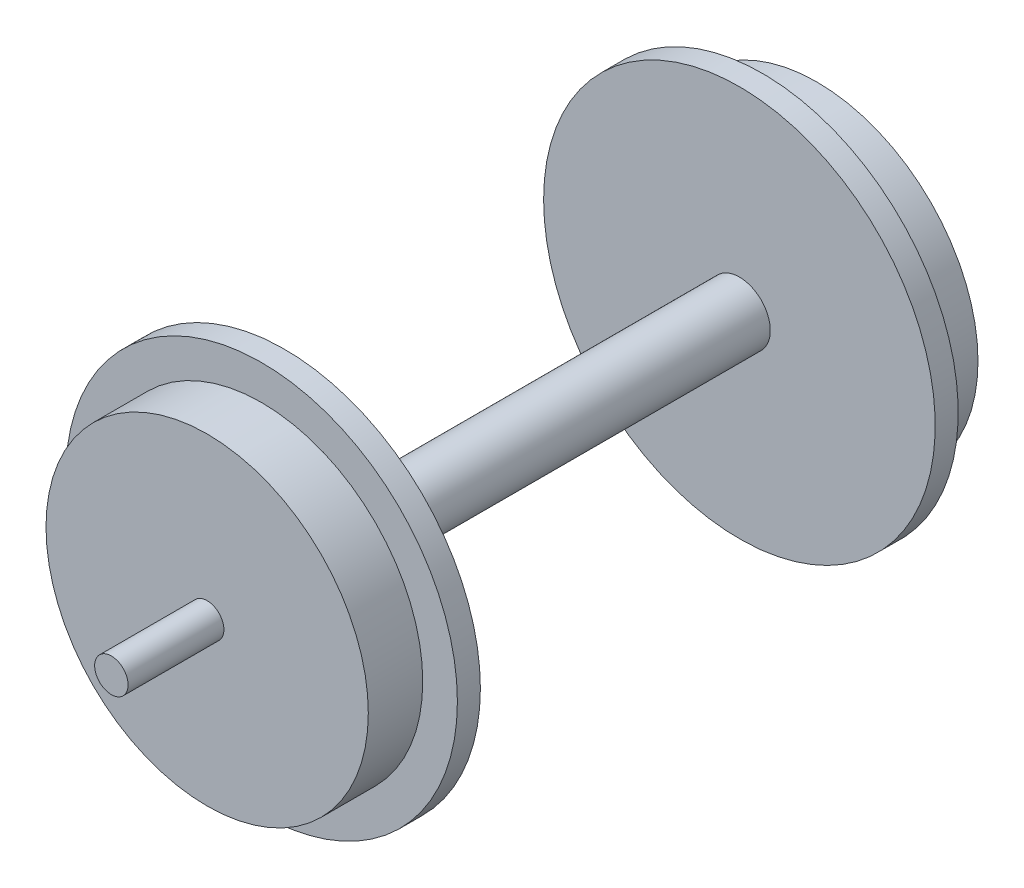
ISO-10303-21;
HEADER;
FILE_DESCRIPTION(('STEP AP214'),'2;1');
FILE_NAME('part.step','',(''),(''),'','','');
FILE_SCHEMA(('AUTOMOTIVE_DESIGN { 1 0 10303 214 1 1 1 1 }'));
ENDSEC;
DATA;
#1=APPLICATION_CONTEXT('core data for automotive mechanical design processes');
#2=APPLICATION_PROTOCOL_DEFINITION('international standard','automotive_design',2000,#1);
#3=PRODUCT_CONTEXT('',#1,'mechanical');
#4=PRODUCT('Part','Part','',(#3));
#5=PRODUCT_RELATED_PRODUCT_CATEGORY('part','',(#4));
#6=PRODUCT_DEFINITION_FORMATION('','',#4);
#7=PRODUCT_DEFINITION_CONTEXT('part definition',#1,'design');
#8=PRODUCT_DEFINITION('design','',#6,#7);
#9=PRODUCT_DEFINITION_SHAPE('','',#8);
#10=(LENGTH_UNIT() NAMED_UNIT(*) SI_UNIT(.MILLI.,.METRE.));
#11=(NAMED_UNIT(*) PLANE_ANGLE_UNIT() SI_UNIT($,.RADIAN.));
#12=(NAMED_UNIT(*) SI_UNIT($,.STERADIAN.) SOLID_ANGLE_UNIT());
#13=UNCERTAINTY_MEASURE_WITH_UNIT(LENGTH_MEASURE(1.E-05),#10,'distance_accuracy_value','');
#14=(GEOMETRIC_REPRESENTATION_CONTEXT(3) GLOBAL_UNCERTAINTY_ASSIGNED_CONTEXT((#13)) GLOBAL_UNIT_ASSIGNED_CONTEXT((#10,
#11,#12)) REPRESENTATION_CONTEXT('',''));
#15=CARTESIAN_POINT('',(0.,0.,0.));
#16=DIRECTION('',(0.,0.,1.));
#17=DIRECTION('',(1.,0.,0.));
#18=AXIS2_PLACEMENT_3D('',#15,#16,#17);
#19=CARTESIAN_POINT('',(0.,0.,2.04));
#20=DIRECTION('',(0.,0.,-1.));
#21=DIRECTION('',(-1.,0.,0.));
#22=AXIS2_PLACEMENT_3D('',#19,#20,#21);
#23=CYLINDRICAL_SURFACE('',#22,17.375);
#24=CARTESIAN_POINT('',(0.,0.,2.04));
#25=DIRECTION('',(0.,0.,1.));
#26=DIRECTION('',(1.,0.,0.));
#27=AXIS2_PLACEMENT_3D('',#24,#25,#26);
#28=CIRCLE('',#27,17.375);
#29=CARTESIAN_POINT('',(17.375,0.,2.04));
#30=VERTEX_POINT('',#29);
#31=EDGE_CURVE('E65',#30,#30,#28,.T.);
#32=ORIENTED_EDGE('',*,*,#31,.F.);
#33=EDGE_LOOP('',(#32));
#34=FACE_BOUND('',#33,.T.);
#35=CARTESIAN_POINT('',(0.,0.,0.));
#36=DIRECTION('',(0.,0.,1.));
#37=DIRECTION('',(1.,0.,0.));
#38=AXIS2_PLACEMENT_3D('',#35,#36,#37);
#39=CIRCLE('',#38,17.375);
#40=CARTESIAN_POINT('',(17.375,0.,0.));
#41=VERTEX_POINT('',#40);
#42=EDGE_CURVE('E37',#41,#41,#39,.T.);
#43=ORIENTED_EDGE('',*,*,#42,.T.);
#44=EDGE_LOOP('',(#43));
#45=FACE_BOUND('',#44,.T.);
#46=ADVANCED_FACE('F34',(#34,#45),#23,.T.);
#47=CARTESIAN_POINT('',(0.,0.,2.04));
#48=DIRECTION('',(0.,0.,1.));
#49=DIRECTION('',(1.,0.,0.));
#50=AXIS2_PLACEMENT_3D('',#47,#48,#49);
#51=PLANE('',#50);
#52=CARTESIAN_POINT('',(0.,0.,2.04));
#53=DIRECTION('',(0.,0.,1.));
#54=DIRECTION('',(1.,0.,0.));
#55=AXIS2_PLACEMENT_3D('',#52,#53,#54);
#56=CIRCLE('',#55,14.3);
#57=CARTESIAN_POINT('',(14.3,0.,2.04));
#58=VERTEX_POINT('',#57);
#59=EDGE_CURVE('E46',#58,#58,#56,.T.);
#60=ORIENTED_EDGE('',*,*,#59,.F.);
#61=EDGE_LOOP('',(#60));
#62=FACE_BOUND('',#61,.T.);
#63=ORIENTED_EDGE('',*,*,#31,.T.);
#64=EDGE_LOOP('',(#63));
#65=FACE_BOUND('',#64,.T.);
#66=ADVANCED_FACE('F76',(#62,#65),#51,.T.);
#67=CARTESIAN_POINT('',(0.,0.,0.));
#68=DIRECTION('',(0.,0.,1.));
#69=DIRECTION('',(1.,0.,0.));
#70=AXIS2_PLACEMENT_3D('',#67,#68,#69);
#71=PLANE('',#70);
#72=CARTESIAN_POINT('',(0.,0.,0.));
#73=DIRECTION('',(0.,0.,-1.));
#74=DIRECTION('',(-1.,0.,0.));
#75=AXIS2_PLACEMENT_3D('',#72,#73,#74);
#76=CIRCLE('',#75,2.74);
#77=CARTESIAN_POINT('',(-2.74,0.,0.));
#78=VERTEX_POINT('',#77);
#79=EDGE_CURVE('E41',#78,#78,#76,.T.);
#80=ORIENTED_EDGE('',*,*,#79,.F.);
#81=EDGE_LOOP('',(#80));
#82=FACE_BOUND('',#81,.T.);
#83=ORIENTED_EDGE('',*,*,#42,.F.);
#84=EDGE_LOOP('',(#83));
#85=FACE_BOUND('',#84,.T.);
#86=ADVANCED_FACE('F73',(#82,#85),#71,.F.);
#87=CARTESIAN_POINT('',(0.,0.,6.87));
#88=DIRECTION('',(0.,0.,-1.));
#89=DIRECTION('',(-1.,0.,0.));
#90=AXIS2_PLACEMENT_3D('',#87,#88,#89);
#91=CYLINDRICAL_SURFACE('',#90,14.3);
#92=CARTESIAN_POINT('',(0.,0.,6.87));
#93=DIRECTION('',(0.,0.,1.));
#94=DIRECTION('',(1.,0.,0.));
#95=AXIS2_PLACEMENT_3D('',#92,#93,#94);
#96=CIRCLE('',#95,14.3);
#97=CARTESIAN_POINT('',(14.3,0.,6.87));
#98=VERTEX_POINT('',#97);
#99=EDGE_CURVE('E60',#98,#98,#96,.T.);
#100=ORIENTED_EDGE('',*,*,#99,.F.);
#101=EDGE_LOOP('',(#100));
#102=FACE_BOUND('',#101,.T.);
#103=ORIENTED_EDGE('',*,*,#59,.T.);
#104=EDGE_LOOP('',(#103));
#105=FACE_BOUND('',#104,.T.);
#106=ADVANCED_FACE('F75',(#102,#105),#91,.T.);
#107=CARTESIAN_POINT('',(0.,0.,6.87));
#108=DIRECTION('',(0.,0.,1.));
#109=DIRECTION('',(1.,0.,0.));
#110=AXIS2_PLACEMENT_3D('',#107,#108,#109);
#111=PLANE('',#110);
#112=CARTESIAN_POINT('',(0.,0.,6.87));
#113=DIRECTION('',(0.,0.,1.));
#114=DIRECTION('',(1.,0.,0.));
#115=AXIS2_PLACEMENT_3D('',#112,#113,#114);
#116=CIRCLE('',#115,1.485);
#117=CARTESIAN_POINT('',(1.485,0.,6.87));
#118=VERTEX_POINT('',#117);
#119=EDGE_CURVE('E223',#118,#118,#116,.T.);
#120=ORIENTED_EDGE('',*,*,#119,.F.);
#121=EDGE_LOOP('',(#120));
#122=FACE_BOUND('',#121,.T.);
#123=ORIENTED_EDGE('',*,*,#99,.T.);
#124=EDGE_LOOP('',(#123));
#125=FACE_BOUND('',#124,.T.);
#126=ADVANCED_FACE('F82',(#122,#125),#111,.T.);
#127=CARTESIAN_POINT('',(0.,0.,-40.36));
#128=DIRECTION('',(0.,0.,1.));
#129=DIRECTION('',(1.,0.,0.));
#130=AXIS2_PLACEMENT_3D('',#127,#128,#129);
#131=CYLINDRICAL_SURFACE('',#130,2.74);
#132=CARTESIAN_POINT('',(0.,0.,-40.36));
#133=DIRECTION('',(0.,0.,-1.));
#134=DIRECTION('',(-1.,0.,0.));
#135=AXIS2_PLACEMENT_3D('',#132,#133,#134);
#136=CIRCLE('',#135,2.74);
#137=CARTESIAN_POINT('',(-2.74,0.,-40.36));
#138=VERTEX_POINT('',#137);
#139=EDGE_CURVE('E55',#138,#138,#136,.T.);
#140=ORIENTED_EDGE('',*,*,#139,.F.);
#141=EDGE_LOOP('',(#140));
#142=FACE_BOUND('',#141,.T.);
#143=ORIENTED_EDGE('',*,*,#79,.T.);
#144=EDGE_LOOP('',(#143));
#145=FACE_BOUND('',#144,.T.);
#146=ADVANCED_FACE('F113',(#142,#145),#131,.T.);
#147=CARTESIAN_POINT('',(0.,0.,-42.4));
#148=DIRECTION('',(0.,0.,1.));
#149=DIRECTION('',(1.,0.,0.));
#150=AXIS2_PLACEMENT_3D('',#147,#148,#149);
#151=CYLINDRICAL_SURFACE('',#150,17.375);
#152=CARTESIAN_POINT('',(0.,0.,-42.4));
#153=DIRECTION('',(0.,0.,-1.));
#154=DIRECTION('',(-1.,0.,0.));
#155=AXIS2_PLACEMENT_3D('',#152,#153,#154);
#156=CIRCLE('',#155,17.375);
#157=CARTESIAN_POINT('',(-17.375,0.,-42.4));
#158=VERTEX_POINT('',#157);
#159=EDGE_CURVE('E52',#158,#158,#156,.T.);
#160=ORIENTED_EDGE('',*,*,#159,.F.);
#161=EDGE_LOOP('',(#160));
#162=FACE_BOUND('',#161,.T.);
#163=CARTESIAN_POINT('',(0.,0.,-40.36));
#164=DIRECTION('',(0.,0.,-1.));
#165=DIRECTION('',(-1.,0.,0.));
#166=AXIS2_PLACEMENT_3D('',#163,#164,#165);
#167=CIRCLE('',#166,17.375);
#168=CARTESIAN_POINT('',(-17.375,0.,-40.36));
#169=VERTEX_POINT('',#168);
#170=EDGE_CURVE('E56',#169,#169,#167,.T.);
#171=ORIENTED_EDGE('',*,*,#170,.T.);
#172=EDGE_LOOP('',(#171));
#173=FACE_BOUND('',#172,.T.);
#174=ADVANCED_FACE('F118',(#162,#173),#151,.T.);
#175=CARTESIAN_POINT('',(0.,0.,-42.4));
#176=DIRECTION('',(0.,0.,-1.));
#177=DIRECTION('',(-1.,0.,0.));
#178=AXIS2_PLACEMENT_3D('',#175,#176,#177);
#179=PLANE('',#178);
#180=CARTESIAN_POINT('',(0.,0.,-42.4));
#181=DIRECTION('',(0.,0.,-1.));
#182=DIRECTION('',(-1.,0.,0.));
#183=AXIS2_PLACEMENT_3D('',#180,#181,#182);
#184=CIRCLE('',#183,14.3);
#185=CARTESIAN_POINT('',(-14.3,0.,-42.4));
#186=VERTEX_POINT('',#185);
#187=EDGE_CURVE('E10',#186,#186,#184,.T.);
#188=ORIENTED_EDGE('',*,*,#187,.F.);
#189=EDGE_LOOP('',(#188));
#190=FACE_BOUND('',#189,.T.);
#191=ORIENTED_EDGE('',*,*,#159,.T.);
#192=EDGE_LOOP('',(#191));
#193=FACE_BOUND('',#192,.T.);
#194=ADVANCED_FACE('F128',(#190,#193),#179,.T.);
#195=CARTESIAN_POINT('',(0.,0.,-40.36));
#196=DIRECTION('',(0.,0.,-1.));
#197=DIRECTION('',(-1.,0.,0.));
#198=AXIS2_PLACEMENT_3D('',#195,#196,#197);
#199=PLANE('',#198);
#200=ORIENTED_EDGE('',*,*,#139,.T.);
#201=EDGE_LOOP('',(#200));
#202=FACE_BOUND('',#201,.T.);
#203=ORIENTED_EDGE('',*,*,#170,.F.);
#204=EDGE_LOOP('',(#203));
#205=FACE_BOUND('',#204,.T.);
#206=ADVANCED_FACE('F136',(#202,#205),#199,.F.);
#207=CARTESIAN_POINT('',(0.,0.,-47.23));
#208=DIRECTION('',(0.,0.,1.));
#209=DIRECTION('',(1.,0.,0.));
#210=AXIS2_PLACEMENT_3D('',#207,#208,#209);
#211=CYLINDRICAL_SURFACE('',#210,14.3);
#212=CARTESIAN_POINT('',(0.,0.,-47.23));
#213=DIRECTION('',(0.,0.,-1.));
#214=DIRECTION('',(-1.,0.,0.));
#215=AXIS2_PLACEMENT_3D('',#212,#213,#214);
#216=CIRCLE('',#215,14.3);
#217=CARTESIAN_POINT('',(-14.3,0.,-47.23));
#218=VERTEX_POINT('',#217);
#219=EDGE_CURVE('E50',#218,#218,#216,.T.);
#220=ORIENTED_EDGE('',*,*,#219,.F.);
#221=EDGE_LOOP('',(#220));
#222=FACE_BOUND('',#221,.T.);
#223=ORIENTED_EDGE('',*,*,#187,.T.);
#224=EDGE_LOOP('',(#223));
#225=FACE_BOUND('',#224,.T.);
#226=ADVANCED_FACE('F141',(#222,#225),#211,.T.);
#227=CARTESIAN_POINT('',(0.,0.,-47.23));
#228=DIRECTION('',(0.,0.,-1.));
#229=DIRECTION('',(-1.,0.,0.));
#230=AXIS2_PLACEMENT_3D('',#227,#228,#229);
#231=PLANE('',#230);
#232=CARTESIAN_POINT('',(0.,0.,-47.23));
#233=DIRECTION('',(0.,0.,-1.));
#234=DIRECTION('',(-1.,0.,0.));
#235=AXIS2_PLACEMENT_3D('',#232,#233,#234);
#236=CIRCLE('',#235,1.485);
#237=CARTESIAN_POINT('',(-1.485,0.,-47.23));
#238=VERTEX_POINT('',#237);
#239=EDGE_CURVE('E222',#238,#238,#236,.T.);
#240=ORIENTED_EDGE('',*,*,#239,.F.);
#241=EDGE_LOOP('',(#240));
#242=FACE_BOUND('',#241,.T.);
#243=ORIENTED_EDGE('',*,*,#219,.T.);
#244=EDGE_LOOP('',(#243));
#245=FACE_BOUND('',#244,.T.);
#246=ADVANCED_FACE('F158',(#242,#245),#231,.T.);
#247=CARTESIAN_POINT('',(0.,0.,-55.73));
#248=DIRECTION('',(0.,0.,1.));
#249=DIRECTION('',(1.,0.,0.));
#250=AXIS2_PLACEMENT_3D('',#247,#248,#249);
#251=CYLINDRICAL_SURFACE('',#250,1.485);
#252=CARTESIAN_POINT('',(0.,0.,-55.73));
#253=DIRECTION('',(0.,0.,-1.));
#254=DIRECTION('',(-1.,0.,0.));
#255=AXIS2_PLACEMENT_3D('',#252,#253,#254);
#256=CIRCLE('',#255,1.485);
#257=CARTESIAN_POINT('',(-1.485,0.,-55.73));
#258=VERTEX_POINT('',#257);
#259=EDGE_CURVE('E226',#258,#258,#256,.T.);
#260=ORIENTED_EDGE('',*,*,#259,.F.);
#261=EDGE_LOOP('',(#260));
#262=FACE_BOUND('',#261,.T.);
#263=ORIENTED_EDGE('',*,*,#239,.T.);
#264=EDGE_LOOP('',(#263));
#265=FACE_BOUND('',#264,.T.);
#266=ADVANCED_FACE('F168',(#262,#265),#251,.T.);
#267=CARTESIAN_POINT('',(0.,0.,-55.73));
#268=DIRECTION('',(0.,0.,-1.));
#269=DIRECTION('',(-1.,0.,0.));
#270=AXIS2_PLACEMENT_3D('',#267,#268,#269);
#271=PLANE('',#270);
#272=ORIENTED_EDGE('',*,*,#259,.T.);
#273=EDGE_LOOP('',(#272));
#274=FACE_BOUND('',#273,.T.);
#275=ADVANCED_FACE('F178',(#274),#271,.T.);
#276=CARTESIAN_POINT('',(0.,0.,15.37));
#277=DIRECTION('',(0.,0.,-1.));
#278=DIRECTION('',(-1.,0.,0.));
#279=AXIS2_PLACEMENT_3D('',#276,#277,#278);
#280=CYLINDRICAL_SURFACE('',#279,1.485);
#281=CARTESIAN_POINT('',(0.,0.,15.37));
#282=DIRECTION('',(0.,0.,1.));
#283=DIRECTION('',(1.,0.,0.));
#284=AXIS2_PLACEMENT_3D('',#281,#282,#283);
#285=CIRCLE('',#284,1.485);
#286=CARTESIAN_POINT('',(1.485,0.,15.37));
#287=VERTEX_POINT('',#286);
#288=EDGE_CURVE('E221',#287,#287,#285,.T.);
#289=ORIENTED_EDGE('',*,*,#288,.F.);
#290=EDGE_LOOP('',(#289));
#291=FACE_BOUND('',#290,.T.);
#292=ORIENTED_EDGE('',*,*,#119,.T.);
#293=EDGE_LOOP('',(#292));
#294=FACE_BOUND('',#293,.T.);
#295=ADVANCED_FACE('F188',(#291,#294),#280,.T.);
#296=CARTESIAN_POINT('',(0.,0.,15.37));
#297=DIRECTION('',(0.,0.,1.));
#298=DIRECTION('',(1.,0.,0.));
#299=AXIS2_PLACEMENT_3D('',#296,#297,#298);
#300=PLANE('',#299);
#301=ORIENTED_EDGE('',*,*,#288,.T.);
#302=EDGE_LOOP('',(#301));
#303=FACE_BOUND('',#302,.T.);
#304=ADVANCED_FACE('F205',(#303),#300,.T.);
#305=CLOSED_SHELL('',(#46,#66,#86,#106,#126,#146,#174,#194,#206,#226,#246,#266,#275,#295,#304));
#306=MANIFOLD_SOLID_BREP('B2',#305);
#307=ADVANCED_BREP_SHAPE_REPRESENTATION('',(#18,#306),#14);
#308=SHAPE_DEFINITION_REPRESENTATION(#9,#307);
ENDSEC;
END-ISO-10303-21;
